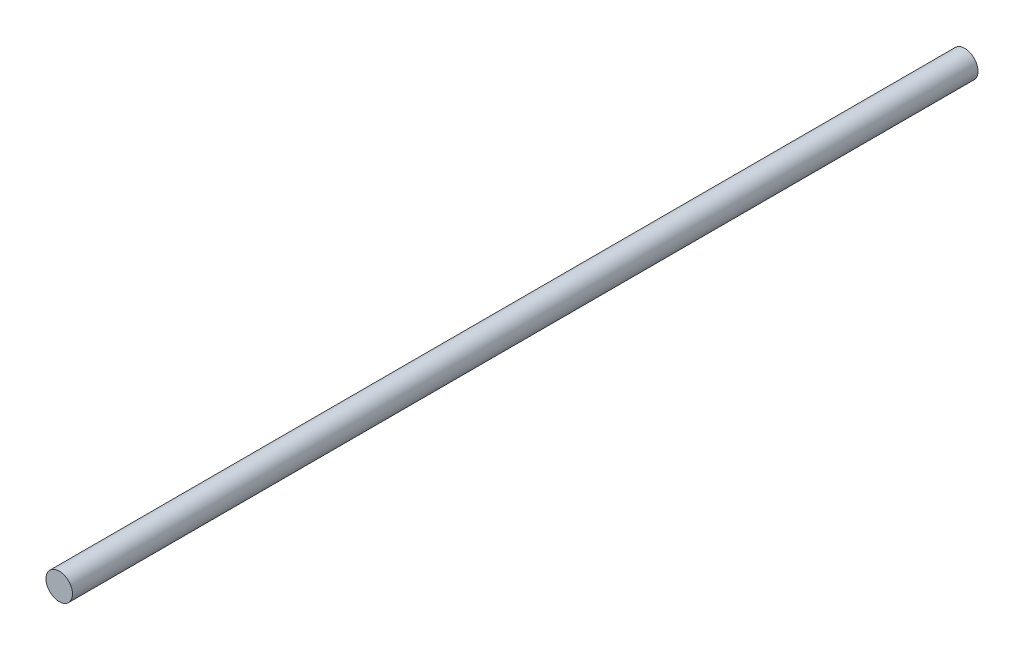
ISO-10303-21;
HEADER;
FILE_DESCRIPTION(('STEP AP214'),'2;1');
FILE_NAME('part.step','',(''),(''),'','','');
FILE_SCHEMA(('AUTOMOTIVE_DESIGN { 1 0 10303 214 1 1 1 1 }'));
ENDSEC;
DATA;
#1=APPLICATION_CONTEXT('core data for automotive mechanical design processes');
#2=APPLICATION_PROTOCOL_DEFINITION('international standard','automotive_design',2000,#1);
#3=PRODUCT_CONTEXT('',#1,'mechanical');
#4=PRODUCT('Part','Part','',(#3));
#5=PRODUCT_RELATED_PRODUCT_CATEGORY('part','',(#4));
#6=PRODUCT_DEFINITION_FORMATION('','',#4);
#7=PRODUCT_DEFINITION_CONTEXT('part definition',#1,'design');
#8=PRODUCT_DEFINITION('design','',#6,#7);
#9=PRODUCT_DEFINITION_SHAPE('','',#8);
#10=(LENGTH_UNIT() NAMED_UNIT(*) SI_UNIT(.MILLI.,.METRE.));
#11=(NAMED_UNIT(*) PLANE_ANGLE_UNIT() SI_UNIT($,.RADIAN.));
#12=(NAMED_UNIT(*) SI_UNIT($,.STERADIAN.) SOLID_ANGLE_UNIT());
#13=UNCERTAINTY_MEASURE_WITH_UNIT(LENGTH_MEASURE(1.E-05),#10,'distance_accuracy_value','');
#14=(GEOMETRIC_REPRESENTATION_CONTEXT(3) GLOBAL_UNCERTAINTY_ASSIGNED_CONTEXT((#13)) GLOBAL_UNIT_ASSIGNED_CONTEXT((#10,
#11,#12)) REPRESENTATION_CONTEXT('',''));
#15=CARTESIAN_POINT('',(0.,0.,0.));
#16=DIRECTION('',(0.,0.,1.));
#17=DIRECTION('',(1.,0.,0.));
#18=AXIS2_PLACEMENT_3D('',#15,#16,#17);
#19=CARTESIAN_POINT('',(0.,0.,205.));
#20=DIRECTION('',(0.,0.,-1.));
#21=DIRECTION('',(-1.,0.,0.));
#22=AXIS2_PLACEMENT_3D('',#19,#20,#21);
#23=CYLINDRICAL_SURFACE('',#22,3.);
#24=CARTESIAN_POINT('',(0.,0.,205.));
#25=DIRECTION('',(0.,0.,1.));
#26=DIRECTION('',(1.,0.,0.));
#27=AXIS2_PLACEMENT_3D('',#24,#25,#26);
#28=CIRCLE('',#27,3.);
#29=CARTESIAN_POINT('',(3.,0.,205.));
#30=VERTEX_POINT('',#29);
#31=EDGE_CURVE('E10',#30,#30,#28,.T.);
#32=ORIENTED_EDGE('',*,*,#31,.F.);
#33=EDGE_LOOP('',(#32));
#34=FACE_BOUND('',#33,.T.);
#35=CARTESIAN_POINT('',(0.,0.,0.));
#36=DIRECTION('',(0.,0.,1.));
#37=DIRECTION('',(1.,0.,0.));
#38=AXIS2_PLACEMENT_3D('',#35,#36,#37);
#39=CIRCLE('',#38,3.);
#40=CARTESIAN_POINT('',(3.,0.,0.));
#41=VERTEX_POINT('',#40);
#42=EDGE_CURVE('E44',#41,#41,#39,.T.);
#43=ORIENTED_EDGE('',*,*,#42,.T.);
#44=EDGE_LOOP('',(#43));
#45=FACE_BOUND('',#44,.T.);
#46=ADVANCED_FACE('F41',(#34,#45),#23,.T.);
#47=CARTESIAN_POINT('',(0.,0.,205.));
#48=DIRECTION('',(0.,0.,1.));
#49=DIRECTION('',(1.,0.,0.));
#50=AXIS2_PLACEMENT_3D('',#47,#48,#49);
#51=PLANE('',#50);
#52=ORIENTED_EDGE('',*,*,#31,.T.);
#53=EDGE_LOOP('',(#52));
#54=FACE_BOUND('',#53,.T.);
#55=ADVANCED_FACE('F58',(#54),#51,.T.);
#56=CARTESIAN_POINT('',(0.,0.,0.));
#57=DIRECTION('',(0.,0.,1.));
#58=DIRECTION('',(1.,0.,0.));
#59=AXIS2_PLACEMENT_3D('',#56,#57,#58);
#60=PLANE('',#59);
#61=ORIENTED_EDGE('',*,*,#42,.F.);
#62=EDGE_LOOP('',(#61));
#63=FACE_BOUND('',#62,.T.);
#64=ADVANCED_FACE('F56',(#63),#60,.F.);
#65=CLOSED_SHELL('',(#46,#55,#64));
#66=MANIFOLD_SOLID_BREP('B2',#65);
#67=ADVANCED_BREP_SHAPE_REPRESENTATION('',(#18,#66),#14);
#68=SHAPE_DEFINITION_REPRESENTATION(#9,#67);
ENDSEC;
END-ISO-10303-21;
